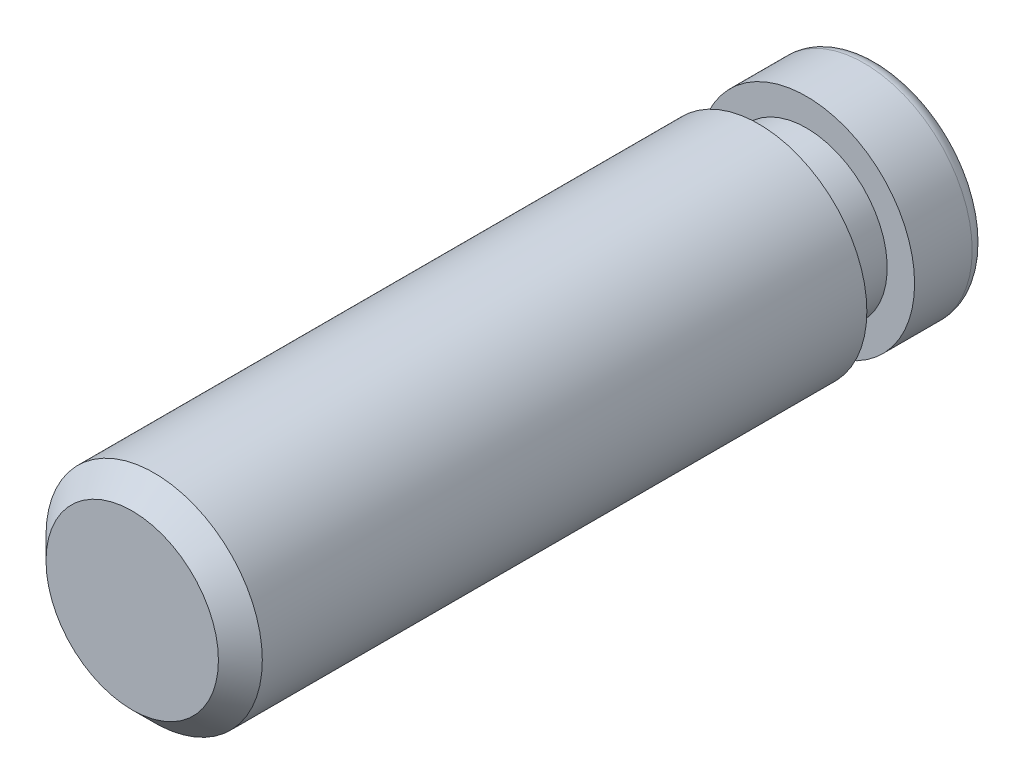
ISO-10303-21;
HEADER;
FILE_DESCRIPTION(('STEP AP214'),'2;1');
FILE_NAME('part.step','',(''),(''),'','','');
FILE_SCHEMA(('AUTOMOTIVE_DESIGN { 1 0 10303 214 1 1 1 1 }'));
ENDSEC;
DATA;
#1=APPLICATION_CONTEXT('core data for automotive mechanical design processes');
#2=APPLICATION_PROTOCOL_DEFINITION('international standard','automotive_design',2000,#1);
#3=PRODUCT_CONTEXT('',#1,'mechanical');
#4=PRODUCT('Part','Part','',(#3));
#5=PRODUCT_RELATED_PRODUCT_CATEGORY('part','',(#4));
#6=PRODUCT_DEFINITION_FORMATION('','',#4);
#7=PRODUCT_DEFINITION_CONTEXT('part definition',#1,'design');
#8=PRODUCT_DEFINITION('design','',#6,#7);
#9=PRODUCT_DEFINITION_SHAPE('','',#8);
#10=(LENGTH_UNIT() NAMED_UNIT(*) SI_UNIT(.MILLI.,.METRE.));
#11=(NAMED_UNIT(*) PLANE_ANGLE_UNIT() SI_UNIT($,.RADIAN.));
#12=(NAMED_UNIT(*) SI_UNIT($,.STERADIAN.) SOLID_ANGLE_UNIT());
#13=UNCERTAINTY_MEASURE_WITH_UNIT(LENGTH_MEASURE(1.E-05),#10,'distance_accuracy_value','');
#14=(GEOMETRIC_REPRESENTATION_CONTEXT(3) GLOBAL_UNCERTAINTY_ASSIGNED_CONTEXT((#13)) GLOBAL_UNIT_ASSIGNED_CONTEXT((#10,
#11,#12)) REPRESENTATION_CONTEXT('',''));
#15=CARTESIAN_POINT('',(0.,0.,0.));
#16=DIRECTION('',(0.,0.,1.));
#17=DIRECTION('',(1.,0.,0.));
#18=AXIS2_PLACEMENT_3D('',#15,#16,#17);
#19=CARTESIAN_POINT('',(0.,0.,6.7437));
#20=DIRECTION('',(0.,0.,-1.));
#21=DIRECTION('',(-1.,0.,0.));
#22=AXIS2_PLACEMENT_3D('',#19,#20,#21);
#23=CYLINDRICAL_SURFACE('',#22,1.9558);
#24=CARTESIAN_POINT('',(0.,0.,6.346825));
#25=DIRECTION('',(0.,0.,1.));
#26=DIRECTION('',(1.,0.,0.));
#27=AXIS2_PLACEMENT_3D('',#24,#25,#26);
#28=CIRCLE('',#27,1.9558);
#29=CARTESIAN_POINT('',(1.9558,0.,6.346825));
#30=VERTEX_POINT('',#29);
#31=EDGE_CURVE('E10',#30,#30,#28,.F.);
#32=ORIENTED_EDGE('',*,*,#31,.T.);
#33=EDGE_LOOP('',(#32));
#34=FACE_BOUND('',#33,.T.);
#35=CARTESIAN_POINT('',(0.,0.,-4.5847));
#36=DIRECTION('',(0.,0.,-1.));
#37=DIRECTION('',(-1.,0.,0.));
#38=AXIS2_PLACEMENT_3D('',#35,#36,#37);
#39=CIRCLE('',#38,1.9558);
#40=CARTESIAN_POINT('',(-1.9558,0.,-4.5847));
#41=VERTEX_POINT('',#40);
#42=EDGE_CURVE('E53',#41,#41,#39,.T.);
#43=ORIENTED_EDGE('',*,*,#42,.F.);
#44=EDGE_LOOP('',(#43));
#45=FACE_BOUND('',#44,.T.);
#46=ADVANCED_FACE('F30',(#34,#45),#23,.T.);
#47=CARTESIAN_POINT('',(0.,0.,6.7437));
#48=DIRECTION('',(0.,0.,1.));
#49=DIRECTION('',(1.,0.,0.));
#50=AXIS2_PLACEMENT_3D('',#47,#48,#49);
#51=PLANE('',#50);
#52=CARTESIAN_POINT('',(0.,0.,6.7437));
#53=DIRECTION('',(0.,0.,1.));
#54=DIRECTION('',(1.,0.,0.));
#55=AXIS2_PLACEMENT_3D('',#52,#53,#54);
#56=CIRCLE('',#55,1.558925);
#57=CARTESIAN_POINT('',(1.558925,0.,6.7437));
#58=VERTEX_POINT('',#57);
#59=EDGE_CURVE('E37',#58,#58,#56,.T.);
#60=ORIENTED_EDGE('',*,*,#59,.T.);
#61=EDGE_LOOP('',(#60));
#62=FACE_BOUND('',#61,.T.);
#63=ADVANCED_FACE('F69',(#62),#51,.T.);
#64=CARTESIAN_POINT('',(0.,0.,-10.042474892396));
#65=DIRECTION('',(0.,0.,-1.));
#66=DIRECTION('',(-1.,0.,0.));
#67=AXIS2_PLACEMENT_3D('',#64,#65,#66);
#68=CYLINDRICAL_SURFACE('',#67,1.4605);
#69=CARTESIAN_POINT('',(0.,0.,-4.5847));
#70=DIRECTION('',(0.,0.,-1.));
#71=DIRECTION('',(-1.,0.,0.));
#72=AXIS2_PLACEMENT_3D('',#69,#70,#71);
#73=CIRCLE('',#72,1.4605);
#74=CARTESIAN_POINT('',(-1.4605,0.,-4.5847));
#75=VERTEX_POINT('',#74);
#76=EDGE_CURVE('E50',#75,#75,#73,.T.);
#77=ORIENTED_EDGE('',*,*,#76,.T.);
#78=EDGE_LOOP('',(#77));
#79=FACE_BOUND('',#78,.T.);
#80=CARTESIAN_POINT('',(0.,0.,-5.4483));
#81=DIRECTION('',(0.,0.,-1.));
#82=DIRECTION('',(-1.,0.,0.));
#83=AXIS2_PLACEMENT_3D('',#80,#81,#82);
#84=CIRCLE('',#83,1.4605);
#85=CARTESIAN_POINT('',(-1.4605,0.,-5.4483));
#86=VERTEX_POINT('',#85);
#87=EDGE_CURVE('E59',#86,#86,#84,.T.);
#88=ORIENTED_EDGE('',*,*,#87,.F.);
#89=EDGE_LOOP('',(#88));
#90=FACE_BOUND('',#89,.T.);
#91=ADVANCED_FACE('F66',(#79,#90),#68,.T.);
#92=CARTESIAN_POINT('',(1.4605,0.,-4.5847));
#93=DIRECTION('',(0.,0.,-1.));
#94=DIRECTION('',(-1.,0.,0.));
#95=AXIS2_PLACEMENT_3D('',#92,#93,#94);
#96=PLANE('',#95);
#97=ORIENTED_EDGE('',*,*,#42,.T.);
#98=EDGE_LOOP('',(#97));
#99=FACE_BOUND('',#98,.T.);
#100=ORIENTED_EDGE('',*,*,#76,.F.);
#101=EDGE_LOOP('',(#100));
#102=FACE_BOUND('',#101,.T.);
#103=ADVANCED_FACE('F68',(#99,#102),#96,.T.);
#104=CARTESIAN_POINT('',(1.4605,0.,-5.4483));
#105=DIRECTION('',(0.,0.,1.));
#106=DIRECTION('',(1.,0.,0.));
#107=AXIS2_PLACEMENT_3D('',#104,#105,#106);
#108=PLANE('',#107);
#109=ORIENTED_EDGE('',*,*,#87,.T.);
#110=EDGE_LOOP('',(#109));
#111=FACE_BOUND('',#110,.T.);
#112=CARTESIAN_POINT('',(0.,0.,-5.4483));
#113=DIRECTION('',(0.,0.,-1.));
#114=DIRECTION('',(-1.,0.,0.));
#115=AXIS2_PLACEMENT_3D('',#112,#113,#114);
#116=CIRCLE('',#115,1.9558);
#117=CARTESIAN_POINT('',(-1.9558,0.,-5.4483));
#118=VERTEX_POINT('',#117);
#119=EDGE_CURVE('E56',#118,#118,#116,.T.);
#120=ORIENTED_EDGE('',*,*,#119,.F.);
#121=EDGE_LOOP('',(#120));
#122=FACE_BOUND('',#121,.T.);
#123=ADVANCED_FACE('F63',(#111,#122),#108,.T.);
#124=CARTESIAN_POINT('',(0.,0.,-6.7437));
#125=DIRECTION('',(0.,0.,1.));
#126=DIRECTION('',(1.,0.,0.));
#127=AXIS2_PLACEMENT_3D('',#124,#125,#126);
#128=PLANE('',#127);
#129=CARTESIAN_POINT('',(0.,0.,-6.7437));
#130=DIRECTION('',(0.,0.,1.));
#131=DIRECTION('',(1.,0.,0.));
#132=AXIS2_PLACEMENT_3D('',#129,#130,#131);
#133=CIRCLE('',#132,1.7018);
#134=CARTESIAN_POINT('',(1.7018,0.,-6.7437));
#135=VERTEX_POINT('',#134);
#136=EDGE_CURVE('E41',#135,#135,#133,.F.);
#137=ORIENTED_EDGE('',*,*,#136,.T.);
#138=EDGE_LOOP('',(#137));
#139=FACE_BOUND('',#138,.T.);
#140=ADVANCED_FACE('F88',(#139),#128,.F.);
#141=CARTESIAN_POINT('',(0.,0.,-6.4897));
#142=DIRECTION('',(0.,0.,1.));
#143=DIRECTION('',(1.,0.,0.));
#144=AXIS2_PLACEMENT_3D('',#141,#142,#143);
#145=CIRCLE('',#144,1.9558);
#146=CARTESIAN_POINT('',(1.9558,0.,-6.4897));
#147=VERTEX_POINT('',#146);
#148=EDGE_CURVE('E45',#147,#147,#145,.T.);
#149=ORIENTED_EDGE('',*,*,#148,.T.);
#150=EDGE_LOOP('',(#149));
#151=FACE_BOUND('',#150,.T.);
#152=ORIENTED_EDGE('',*,*,#119,.T.);
#153=EDGE_LOOP('',(#152));
#154=FACE_BOUND('',#153,.T.);
#155=ADVANCED_FACE('F81',(#151,#154),#23,.T.);
#156=CARTESIAN_POINT('',(0.,0.,-6.4897));
#157=DIRECTION('',(0.,0.,1.));
#158=DIRECTION('',(1.,0.,0.));
#159=AXIS2_PLACEMENT_3D('',#156,#157,#158);
#160=TOROIDAL_SURFACE('',#159,1.7018,0.254);
#161=ORIENTED_EDGE('',*,*,#136,.F.);
#162=EDGE_LOOP('',(#161));
#163=FACE_BOUND('',#162,.T.);
#164=ORIENTED_EDGE('',*,*,#148,.F.);
#165=EDGE_LOOP('',(#164));
#166=FACE_BOUND('',#165,.T.);
#167=ADVANCED_FACE('F87',(#163,#166),#160,.T.);
#168=CARTESIAN_POINT('',(0.,0.,6.7437));
#169=DIRECTION('',(0.,0.,-1.));
#170=DIRECTION('',(-1.,0.,0.));
#171=AXIS2_PLACEMENT_3D('',#168,#169,#170);
#172=CONICAL_SURFACE('',#171,1.558925,0.785398163397447);
#173=ORIENTED_EDGE('',*,*,#31,.F.);
#174=EDGE_LOOP('',(#173));
#175=FACE_BOUND('',#174,.T.);
#176=ORIENTED_EDGE('',*,*,#59,.F.);
#177=EDGE_LOOP('',(#176));
#178=FACE_BOUND('',#177,.T.);
#179=ADVANCED_FACE('F32',(#175,#178),#172,.T.);
#180=CLOSED_SHELL('',(#46,#63,#91,#103,#123,#140,#155,#167,#179));
#181=MANIFOLD_SOLID_BREP('B2',#180);
#182=ADVANCED_BREP_SHAPE_REPRESENTATION('',(#18,#181),#14);
#183=SHAPE_DEFINITION_REPRESENTATION(#9,#182);
ENDSEC;
END-ISO-10303-21;
